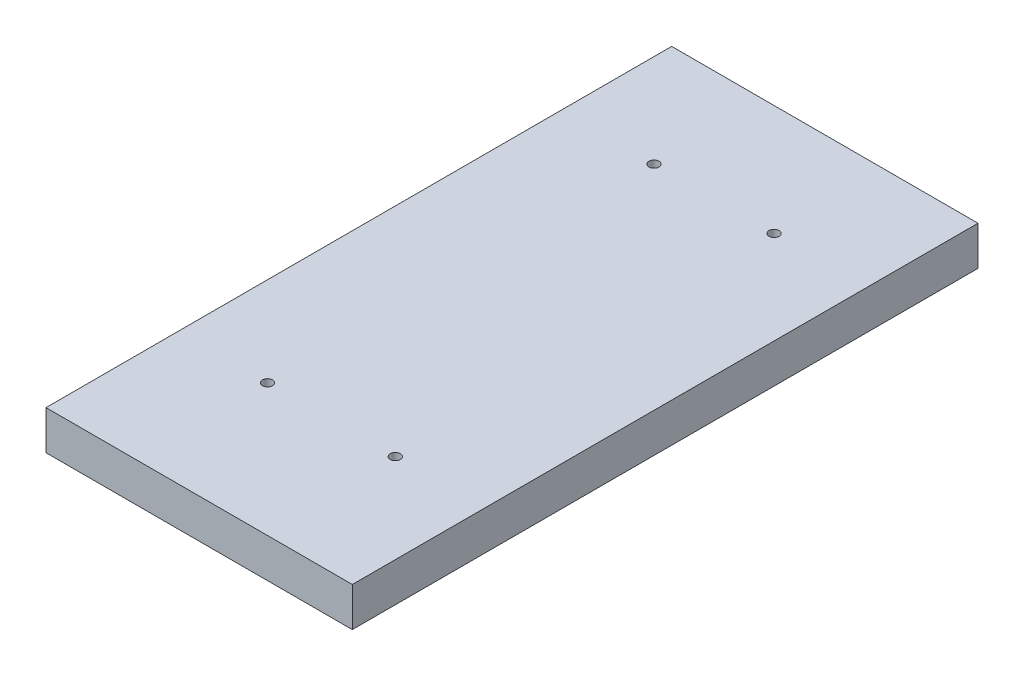
ISO-10303-21;
HEADER;
FILE_DESCRIPTION(('STEP AP214'),'2;1');
FILE_NAME('part.step','',(''),(''),'','','');
FILE_SCHEMA(('AUTOMOTIVE_DESIGN { 1 0 10303 214 1 1 1 1 }'));
ENDSEC;
DATA;
#1=APPLICATION_CONTEXT('core data for automotive mechanical design processes');
#2=APPLICATION_PROTOCOL_DEFINITION('international standard','automotive_design',2000,#1);
#3=PRODUCT_CONTEXT('',#1,'mechanical');
#4=PRODUCT('Part','Part','',(#3));
#5=PRODUCT_RELATED_PRODUCT_CATEGORY('part','',(#4));
#6=PRODUCT_DEFINITION_FORMATION('','',#4);
#7=PRODUCT_DEFINITION_CONTEXT('part definition',#1,'design');
#8=PRODUCT_DEFINITION('design','',#6,#7);
#9=PRODUCT_DEFINITION_SHAPE('','',#8);
#10=(LENGTH_UNIT() NAMED_UNIT(*) SI_UNIT(.MILLI.,.METRE.));
#11=(NAMED_UNIT(*) PLANE_ANGLE_UNIT() SI_UNIT($,.RADIAN.));
#12=(NAMED_UNIT(*) SI_UNIT($,.STERADIAN.) SOLID_ANGLE_UNIT());
#13=UNCERTAINTY_MEASURE_WITH_UNIT(LENGTH_MEASURE(1.E-05),#10,'distance_accuracy_value','');
#14=(GEOMETRIC_REPRESENTATION_CONTEXT(3) GLOBAL_UNCERTAINTY_ASSIGNED_CONTEXT((#13)) GLOBAL_UNIT_ASSIGNED_CONTEXT((#10,
#11,#12)) REPRESENTATION_CONTEXT('',''));
#15=CARTESIAN_POINT('',(0.,0.,0.));
#16=DIRECTION('',(0.,0.,1.));
#17=DIRECTION('',(1.,0.,0.));
#18=AXIS2_PLACEMENT_3D('',#15,#16,#17);
#19=CARTESIAN_POINT('',(74.6125,19.05,152.4));
#20=DIRECTION('',(-1.,0.,0.));
#21=DIRECTION('',(0.,0.,1.));
#22=AXIS2_PLACEMENT_3D('',#19,#20,#21);
#23=PLANE('',#22);
#24=DIRECTION('',(0.,0.,-1.));
#25=VECTOR('',#24,1.);
#26=CARTESIAN_POINT('',(74.6125,0.,152.4));
#27=LINE('',#26,#25);
#28=CARTESIAN_POINT('',(74.6125,0.,152.4));
#29=VERTEX_POINT('',#28);
#30=CARTESIAN_POINT('',(74.6125,0.,-152.4));
#31=VERTEX_POINT('',#30);
#32=EDGE_CURVE('E100',#29,#31,#27,.T.);
#33=ORIENTED_EDGE('',*,*,#32,.T.);
#34=DIRECTION('',(0.,-1.,0.));
#35=VECTOR('',#34,1.);
#36=CARTESIAN_POINT('',(74.6125,19.05,-152.4));
#37=LINE('',#36,#35);
#38=CARTESIAN_POINT('',(74.6125,19.05,-152.4));
#39=VERTEX_POINT('',#38);
#40=EDGE_CURVE('E11',#39,#31,#37,.T.);
#41=ORIENTED_EDGE('',*,*,#40,.F.);
#42=DIRECTION('',(0.,0.,-1.));
#43=VECTOR('',#42,1.);
#44=CARTESIAN_POINT('',(74.6125,19.05,152.4));
#45=LINE('',#44,#43);
#46=CARTESIAN_POINT('',(74.6125,19.05,152.4));
#47=VERTEX_POINT('',#46);
#48=EDGE_CURVE('E88',#47,#39,#45,.T.);
#49=ORIENTED_EDGE('',*,*,#48,.F.);
#50=DIRECTION('',(0.,-1.,0.));
#51=VECTOR('',#50,1.);
#52=CARTESIAN_POINT('',(74.6125,19.05,152.4));
#53=LINE('',#52,#51);
#54=EDGE_CURVE('E96',#47,#29,#53,.T.);
#55=ORIENTED_EDGE('',*,*,#54,.T.);
#56=EDGE_LOOP('',(#33,#41,#49,#55));
#57=FACE_BOUND('',#56,.T.);
#58=ADVANCED_FACE('F37',(#57),#23,.F.);
#59=CARTESIAN_POINT('',(-74.6125,19.05,-152.4));
#60=DIRECTION('',(0.,0.,1.));
#61=DIRECTION('',(1.,0.,0.));
#62=AXIS2_PLACEMENT_3D('',#59,#60,#61);
#63=PLANE('',#62);
#64=DIRECTION('',(-1.,0.,0.));
#65=VECTOR('',#64,1.);
#66=CARTESIAN_POINT('',(-74.6125,0.,-152.4));
#67=LINE('',#66,#65);
#68=CARTESIAN_POINT('',(-74.6125,0.,-152.4));
#69=VERTEX_POINT('',#68);
#70=EDGE_CURVE('E92',#31,#69,#67,.T.);
#71=ORIENTED_EDGE('',*,*,#70,.T.);
#72=DIRECTION('',(0.,-1.,0.));
#73=VECTOR('',#72,1.);
#74=CARTESIAN_POINT('',(-74.6125,19.05,-152.4));
#75=LINE('',#74,#73);
#76=CARTESIAN_POINT('',(-74.6125,19.05,-152.4));
#77=VERTEX_POINT('',#76);
#78=EDGE_CURVE('E45',#77,#69,#75,.T.);
#79=ORIENTED_EDGE('',*,*,#78,.F.);
#80=DIRECTION('',(-1.,0.,0.));
#81=VECTOR('',#80,1.);
#82=CARTESIAN_POINT('',(-74.6125,19.05,-152.4));
#83=LINE('',#82,#81);
#84=EDGE_CURVE('E83',#39,#77,#83,.T.);
#85=ORIENTED_EDGE('',*,*,#84,.F.);
#86=ORIENTED_EDGE('',*,*,#40,.T.);
#87=EDGE_LOOP('',(#71,#79,#85,#86));
#88=FACE_BOUND('',#87,.T.);
#89=ADVANCED_FACE('F91',(#88),#63,.F.);
#90=CARTESIAN_POINT('',(-74.6125,19.05,152.4));
#91=DIRECTION('',(1.,0.,0.));
#92=DIRECTION('',(0.,0.,-1.));
#93=AXIS2_PLACEMENT_3D('',#90,#91,#92);
#94=PLANE('',#93);
#95=DIRECTION('',(0.,0.,1.));
#96=VECTOR('',#95,1.);
#97=CARTESIAN_POINT('',(-74.6125,0.,152.4));
#98=LINE('',#97,#96);
#99=CARTESIAN_POINT('',(-74.6125,0.,152.4));
#100=VERTEX_POINT('',#99);
#101=EDGE_CURVE('E70',#69,#100,#98,.T.);
#102=ORIENTED_EDGE('',*,*,#101,.T.);
#103=DIRECTION('',(0.,-1.,0.));
#104=VECTOR('',#103,1.);
#105=CARTESIAN_POINT('',(-74.6125,19.05,152.4));
#106=LINE('',#105,#104);
#107=CARTESIAN_POINT('',(-74.6125,19.05,152.4));
#108=VERTEX_POINT('',#107);
#109=EDGE_CURVE('E93',#108,#100,#106,.T.);
#110=ORIENTED_EDGE('',*,*,#109,.F.);
#111=DIRECTION('',(0.,0.,1.));
#112=VECTOR('',#111,1.);
#113=CARTESIAN_POINT('',(-74.6125,19.05,152.4));
#114=LINE('',#113,#112);
#115=EDGE_CURVE('E86',#77,#108,#114,.T.);
#116=ORIENTED_EDGE('',*,*,#115,.F.);
#117=ORIENTED_EDGE('',*,*,#78,.T.);
#118=EDGE_LOOP('',(#102,#110,#116,#117));
#119=FACE_BOUND('',#118,.T.);
#120=ADVANCED_FACE('F94',(#119),#94,.F.);
#121=CARTESIAN_POINT('',(-74.6125,19.05,152.4));
#122=DIRECTION('',(0.,0.,-1.));
#123=DIRECTION('',(-1.,0.,0.));
#124=AXIS2_PLACEMENT_3D('',#121,#122,#123);
#125=PLANE('',#124);
#126=DIRECTION('',(1.,0.,0.));
#127=VECTOR('',#126,1.);
#128=CARTESIAN_POINT('',(-74.6125,0.,152.4));
#129=LINE('',#128,#127);
#130=EDGE_CURVE('E76',#100,#29,#129,.T.);
#131=ORIENTED_EDGE('',*,*,#130,.T.);
#132=ORIENTED_EDGE('',*,*,#54,.F.);
#133=DIRECTION('',(1.,0.,0.));
#134=VECTOR('',#133,1.);
#135=CARTESIAN_POINT('',(-74.6125,19.05,152.4));
#136=LINE('',#135,#134);
#137=EDGE_CURVE('E53',#108,#47,#136,.T.);
#138=ORIENTED_EDGE('',*,*,#137,.F.);
#139=ORIENTED_EDGE('',*,*,#109,.T.);
#140=EDGE_LOOP('',(#131,#132,#138,#139));
#141=FACE_BOUND('',#140,.T.);
#142=ADVANCED_FACE('F108',(#141),#125,.F.);
#143=CARTESIAN_POINT('',(0.,19.05,0.));
#144=DIRECTION('',(0.,-1.,0.));
#145=DIRECTION('',(0.,0.,-1.));
#146=AXIS2_PLACEMENT_3D('',#143,#144,#145);
#147=PLANE('',#146);
#148=CARTESIAN_POINT('',(-31.1249999999999,19.05,87.9856));
#149=DIRECTION('',(0.,1.,0.));
#150=DIRECTION('',(0.,0.,1.));
#151=AXIS2_PLACEMENT_3D('',#148,#149,#150);
#152=CIRCLE('',#151,2.45744999999999);
#153=CARTESIAN_POINT('',(-31.1249999999999,19.05,90.44305));
#154=VERTEX_POINT('',#153);
#155=EDGE_CURVE('E134',#154,#154,#152,.T.);
#156=ORIENTED_EDGE('',*,*,#155,.F.);
#157=EDGE_LOOP('',(#156));
#158=FACE_BOUND('',#157,.T.);
#159=CARTESIAN_POINT('',(31.125,19.05,87.9856));
#160=DIRECTION('',(0.,1.,0.));
#161=DIRECTION('',(0.,0.,1.));
#162=AXIS2_PLACEMENT_3D('',#159,#160,#161);
#163=CIRCLE('',#162,2.45744999999999);
#164=CARTESIAN_POINT('',(31.125,19.05,90.44305));
#165=VERTEX_POINT('',#164);
#166=EDGE_CURVE('E128',#165,#165,#163,.T.);
#167=ORIENTED_EDGE('',*,*,#166,.F.);
#168=EDGE_LOOP('',(#167));
#169=FACE_BOUND('',#168,.T.);
#170=CARTESIAN_POINT('',(-29.2481519840108,19.05,-98.425));
#171=DIRECTION('',(0.,1.,0.));
#172=DIRECTION('',(0.,0.,1.));
#173=AXIS2_PLACEMENT_3D('',#170,#171,#172);
#174=CIRCLE('',#173,2.45744999999999);
#175=CARTESIAN_POINT('',(-29.2481519840108,19.05,-95.96755));
#176=VERTEX_POINT('',#175);
#177=EDGE_CURVE('E122',#176,#176,#174,.T.);
#178=ORIENTED_EDGE('',*,*,#177,.F.);
#179=EDGE_LOOP('',(#178));
#180=FACE_BOUND('',#179,.T.);
#181=CARTESIAN_POINT('',(29.2481519840108,19.05,-98.425));
#182=DIRECTION('',(0.,1.,0.));
#183=DIRECTION('',(0.,0.,1.));
#184=AXIS2_PLACEMENT_3D('',#181,#182,#183);
#185=CIRCLE('',#184,2.45744999999999);
#186=CARTESIAN_POINT('',(29.2481519840108,19.05,-95.96755));
#187=VERTEX_POINT('',#186);
#188=EDGE_CURVE('E116',#187,#187,#185,.T.);
#189=ORIENTED_EDGE('',*,*,#188,.F.);
#190=EDGE_LOOP('',(#189));
#191=FACE_BOUND('',#190,.T.);
#192=ORIENTED_EDGE('',*,*,#48,.T.);
#193=ORIENTED_EDGE('',*,*,#84,.T.);
#194=ORIENTED_EDGE('',*,*,#115,.T.);
#195=ORIENTED_EDGE('',*,*,#137,.T.);
#196=EDGE_LOOP('',(#192,#193,#194,#195));
#197=FACE_BOUND('',#196,.T.);
#198=ADVANCED_FACE('F84',(#158,#169,#180,#191,#197),#147,.F.);
#199=CARTESIAN_POINT('',(0.,0.,0.));
#200=DIRECTION('',(0.,-1.,0.));
#201=DIRECTION('',(0.,0.,-1.));
#202=AXIS2_PLACEMENT_3D('',#199,#200,#201);
#203=PLANE('',#202);
#204=CARTESIAN_POINT('',(-31.1249999999999,0.,87.9856));
#205=DIRECTION('',(0.,1.,0.));
#206=DIRECTION('',(0.,0.,1.));
#207=AXIS2_PLACEMENT_3D('',#204,#205,#206);
#208=CIRCLE('',#207,2.45744999999999);
#209=CARTESIAN_POINT('',(-31.1249999999999,0.,90.44305));
#210=VERTEX_POINT('',#209);
#211=EDGE_CURVE('E131',#210,#210,#208,.T.);
#212=ORIENTED_EDGE('',*,*,#211,.T.);
#213=EDGE_LOOP('',(#212));
#214=FACE_BOUND('',#213,.T.);
#215=CARTESIAN_POINT('',(31.125,0.,87.9856));
#216=DIRECTION('',(0.,1.,0.));
#217=DIRECTION('',(0.,0.,1.));
#218=AXIS2_PLACEMENT_3D('',#215,#216,#217);
#219=CIRCLE('',#218,2.45744999999999);
#220=CARTESIAN_POINT('',(31.125,0.,90.44305));
#221=VERTEX_POINT('',#220);
#222=EDGE_CURVE('E125',#221,#221,#219,.T.);
#223=ORIENTED_EDGE('',*,*,#222,.T.);
#224=EDGE_LOOP('',(#223));
#225=FACE_BOUND('',#224,.T.);
#226=CARTESIAN_POINT('',(-29.2481519840108,0.,-98.425));
#227=DIRECTION('',(0.,1.,0.));
#228=DIRECTION('',(0.,0.,1.));
#229=AXIS2_PLACEMENT_3D('',#226,#227,#228);
#230=CIRCLE('',#229,2.45744999999999);
#231=CARTESIAN_POINT('',(-29.2481519840108,0.,-95.96755));
#232=VERTEX_POINT('',#231);
#233=EDGE_CURVE('E119',#232,#232,#230,.T.);
#234=ORIENTED_EDGE('',*,*,#233,.T.);
#235=EDGE_LOOP('',(#234));
#236=FACE_BOUND('',#235,.T.);
#237=CARTESIAN_POINT('',(29.2481519840108,0.,-98.425));
#238=DIRECTION('',(0.,1.,0.));
#239=DIRECTION('',(0.,0.,1.));
#240=AXIS2_PLACEMENT_3D('',#237,#238,#239);
#241=CIRCLE('',#240,2.45744999999999);
#242=CARTESIAN_POINT('',(29.2481519840108,0.,-95.96755));
#243=VERTEX_POINT('',#242);
#244=EDGE_CURVE('E103',#243,#243,#241,.T.);
#245=ORIENTED_EDGE('',*,*,#244,.T.);
#246=EDGE_LOOP('',(#245));
#247=FACE_BOUND('',#246,.T.);
#248=ORIENTED_EDGE('',*,*,#32,.F.);
#249=ORIENTED_EDGE('',*,*,#130,.F.);
#250=ORIENTED_EDGE('',*,*,#101,.F.);
#251=ORIENTED_EDGE('',*,*,#70,.F.);
#252=EDGE_LOOP('',(#248,#249,#250,#251));
#253=FACE_BOUND('',#252,.T.);
#254=ADVANCED_FACE('F111',(#214,#225,#236,#247,#253),#203,.T.);
#255=CARTESIAN_POINT('',(29.2481519840108,19.05,-98.425));
#256=DIRECTION('',(0.,1.,0.));
#257=DIRECTION('',(0.,0.,1.));
#258=AXIS2_PLACEMENT_3D('',#255,#256,#257);
#259=CYLINDRICAL_SURFACE('',#258,2.45744999999999);
#260=ORIENTED_EDGE('',*,*,#244,.F.);
#261=EDGE_LOOP('',(#260));
#262=FACE_BOUND('',#261,.T.);
#263=ORIENTED_EDGE('',*,*,#188,.T.);
#264=EDGE_LOOP('',(#263));
#265=FACE_BOUND('',#264,.T.);
#266=ADVANCED_FACE('F149',(#262,#265),#259,.F.);
#267=CARTESIAN_POINT('',(-29.2481519840108,19.05,-98.425));
#268=DIRECTION('',(0.,1.,0.));
#269=DIRECTION('',(0.,0.,1.));
#270=AXIS2_PLACEMENT_3D('',#267,#268,#269);
#271=CYLINDRICAL_SURFACE('',#270,2.45744999999999);
#272=ORIENTED_EDGE('',*,*,#233,.F.);
#273=EDGE_LOOP('',(#272));
#274=FACE_BOUND('',#273,.T.);
#275=ORIENTED_EDGE('',*,*,#177,.T.);
#276=EDGE_LOOP('',(#275));
#277=FACE_BOUND('',#276,.T.);
#278=ADVANCED_FACE('F151',(#274,#277),#271,.F.);
#279=CARTESIAN_POINT('',(31.125,19.05,87.9856));
#280=DIRECTION('',(0.,1.,0.));
#281=DIRECTION('',(0.,0.,1.));
#282=AXIS2_PLACEMENT_3D('',#279,#280,#281);
#283=CYLINDRICAL_SURFACE('',#282,2.45744999999999);
#284=ORIENTED_EDGE('',*,*,#222,.F.);
#285=EDGE_LOOP('',(#284));
#286=FACE_BOUND('',#285,.T.);
#287=ORIENTED_EDGE('',*,*,#166,.T.);
#288=EDGE_LOOP('',(#287));
#289=FACE_BOUND('',#288,.T.);
#290=ADVANCED_FACE('F158',(#286,#289),#283,.F.);
#291=CARTESIAN_POINT('',(-31.1249999999999,19.05,87.9856));
#292=DIRECTION('',(0.,1.,0.));
#293=DIRECTION('',(0.,0.,1.));
#294=AXIS2_PLACEMENT_3D('',#291,#292,#293);
#295=CYLINDRICAL_SURFACE('',#294,2.45744999999999);
#296=ORIENTED_EDGE('',*,*,#211,.F.);
#297=EDGE_LOOP('',(#296));
#298=FACE_BOUND('',#297,.T.);
#299=ORIENTED_EDGE('',*,*,#155,.T.);
#300=EDGE_LOOP('',(#299));
#301=FACE_BOUND('',#300,.T.);
#302=ADVANCED_FACE('F138',(#298,#301),#295,.F.);
#303=CLOSED_SHELL('',(#58,#89,#120,#142,#198,#254,#266,#278,#290,#302));
#304=MANIFOLD_SOLID_BREP('B2',#303);
#305=ADVANCED_BREP_SHAPE_REPRESENTATION('',(#18,#304),#14);
#306=SHAPE_DEFINITION_REPRESENTATION(#9,#305);
ENDSEC;
END-ISO-10303-21;
